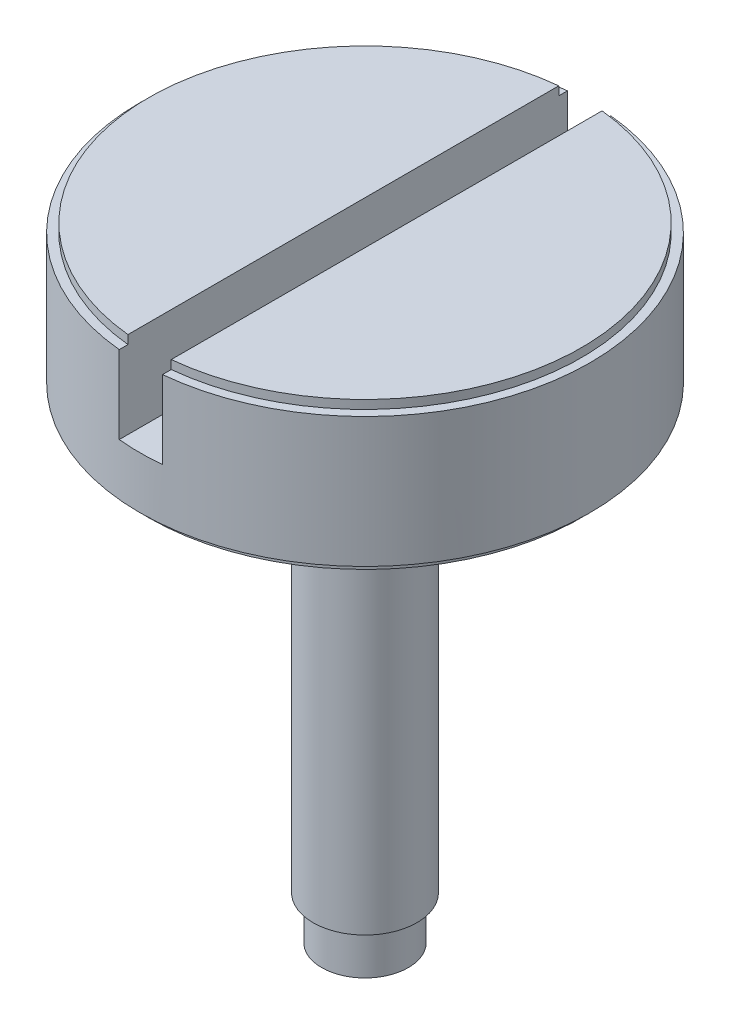
ISO-10303-21;
HEADER;
FILE_DESCRIPTION(('STEP AP214'),'2;1');
FILE_NAME('part.step','',(''),(''),'','','');
FILE_SCHEMA(('AUTOMOTIVE_DESIGN { 1 0 10303 214 1 1 1 1 }'));
ENDSEC;
DATA;
#1=APPLICATION_CONTEXT('core data for automotive mechanical design processes');
#2=APPLICATION_PROTOCOL_DEFINITION('international standard','automotive_design',2000,#1);
#3=PRODUCT_CONTEXT('',#1,'mechanical');
#4=PRODUCT('Part','Part','',(#3));
#5=PRODUCT_RELATED_PRODUCT_CATEGORY('part','',(#4));
#6=PRODUCT_DEFINITION_FORMATION('','',#4);
#7=PRODUCT_DEFINITION_CONTEXT('part definition',#1,'design');
#8=PRODUCT_DEFINITION('design','',#6,#7);
#9=PRODUCT_DEFINITION_SHAPE('','',#8);
#10=(LENGTH_UNIT() NAMED_UNIT(*) SI_UNIT(.MILLI.,.METRE.));
#11=(NAMED_UNIT(*) PLANE_ANGLE_UNIT() SI_UNIT($,.RADIAN.));
#12=(NAMED_UNIT(*) SI_UNIT($,.STERADIAN.) SOLID_ANGLE_UNIT());
#13=UNCERTAINTY_MEASURE_WITH_UNIT(LENGTH_MEASURE(1.E-05),#10,'distance_accuracy_value','');
#14=(GEOMETRIC_REPRESENTATION_CONTEXT(3) GLOBAL_UNCERTAINTY_ASSIGNED_CONTEXT((#13)) GLOBAL_UNIT_ASSIGNED_CONTEXT((#10,
#11,#12)) REPRESENTATION_CONTEXT('',''));
#15=CARTESIAN_POINT('',(0.,0.,0.));
#16=DIRECTION('',(0.,0.,1.));
#17=DIRECTION('',(1.,0.,0.));
#18=AXIS2_PLACEMENT_3D('',#15,#16,#17);
#19=CARTESIAN_POINT('',(0.,14.2,0.));
#20=DIRECTION('',(0.,1.,0.));
#21=DIRECTION('',(0.,0.,1.));
#22=AXIS2_PLACEMENT_3D('',#19,#20,#21);
#23=PLANE('',#22);
#24=DIRECTION('',(0.,0.,1.));
#25=VECTOR('',#24,1.);
#26=CARTESIAN_POINT('',(-0.5,14.2,0.));
#27=LINE('',#26,#25);
#28=CARTESIAN_POINT('',(-0.5,14.2,-5.17590571784301));
#29=VERTEX_POINT('',#28);
#30=CARTESIAN_POINT('',(-0.5,14.2,-4.9749371855331));
#31=VERTEX_POINT('',#30);
#32=EDGE_CURVE('E238',#29,#31,#27,.T.);
#33=ORIENTED_EDGE('',*,*,#32,.F.);
#34=CARTESIAN_POINT('',(0.,14.2,0.));
#35=DIRECTION('',(0.,1.,0.));
#36=DIRECTION('',(0.,0.,1.));
#37=AXIS2_PLACEMENT_3D('',#34,#35,#36);
#38=CIRCLE('',#37,5.2);
#39=CARTESIAN_POINT('',(-0.5,14.2,5.17590571784301));
#40=VERTEX_POINT('',#39);
#41=EDGE_CURVE('E142',#29,#40,#38,.T.);
#42=ORIENTED_EDGE('',*,*,#41,.T.);
#43=CARTESIAN_POINT('',(-0.5,14.2,4.9749371855331));
#44=VERTEX_POINT('',#43);
#45=EDGE_CURVE('E236',#44,#40,#27,.T.);
#46=ORIENTED_EDGE('',*,*,#45,.F.);
#47=CARTESIAN_POINT('',(0.,14.2,0.));
#48=DIRECTION('',(0.,1.,0.));
#49=DIRECTION('',(0.,0.,1.));
#50=AXIS2_PLACEMENT_3D('',#47,#48,#49);
#51=CIRCLE('',#50,5.);
#52=EDGE_CURVE('E149',#31,#44,#51,.T.);
#53=ORIENTED_EDGE('',*,*,#52,.F.);
#54=EDGE_LOOP('',(#33,#42,#46,#53));
#55=FACE_BOUND('',#54,.T.);
#56=ADVANCED_FACE('F55',(#55),#23,.T.);
#57=CARTESIAN_POINT('',(0.,14.4,0.));
#58=DIRECTION('',(0.,-1.,0.));
#59=DIRECTION('',(0.,0.,-1.));
#60=AXIS2_PLACEMENT_3D('',#57,#58,#59);
#61=CYLINDRICAL_SURFACE('',#60,5.);
#62=CARTESIAN_POINT('',(0.,14.4,0.));
#63=DIRECTION('',(0.,1.,0.));
#64=DIRECTION('',(0.,0.,1.));
#65=AXIS2_PLACEMENT_3D('',#62,#63,#64);
#66=CIRCLE('',#65,5.);
#67=CARTESIAN_POINT('',(-0.5,14.4,-4.9749371855331));
#68=VERTEX_POINT('',#67);
#69=CARTESIAN_POINT('',(-0.5,14.4,4.9749371855331));
#70=VERTEX_POINT('',#69);
#71=EDGE_CURVE('E139',#68,#70,#66,.T.);
#72=ORIENTED_EDGE('',*,*,#71,.F.);
#73=DIRECTION('',(0.,-1.,0.));
#74=VECTOR('',#73,1.);
#75=CARTESIAN_POINT('',(-0.5,14.4,-4.9749371855331));
#76=LINE('',#75,#74);
#77=EDGE_CURVE('E239',#68,#31,#76,.T.);
#78=ORIENTED_EDGE('',*,*,#77,.T.);
#79=ORIENTED_EDGE('',*,*,#52,.T.);
#80=DIRECTION('',(0.,-1.,0.));
#81=VECTOR('',#80,1.);
#82=CARTESIAN_POINT('',(-0.5,14.4,4.9749371855331));
#83=LINE('',#82,#81);
#84=EDGE_CURVE('E234',#44,#70,#83,.F.);
#85=ORIENTED_EDGE('',*,*,#84,.T.);
#86=EDGE_LOOP('',(#72,#78,#79,#85));
#87=FACE_BOUND('',#86,.T.);
#88=ADVANCED_FACE('F245',(#87),#61,.T.);
#89=CARTESIAN_POINT('',(0.,14.4,0.));
#90=DIRECTION('',(0.,1.,0.));
#91=DIRECTION('',(0.,0.,1.));
#92=AXIS2_PLACEMENT_3D('',#89,#90,#91);
#93=PLANE('',#92);
#94=DIRECTION('',(0.,0.,1.));
#95=VECTOR('',#94,1.);
#96=CARTESIAN_POINT('',(-0.5,14.4,0.));
#97=LINE('',#96,#95);
#98=EDGE_CURVE('E125',#68,#70,#97,.T.);
#99=ORIENTED_EDGE('',*,*,#98,.F.);
#100=ORIENTED_EDGE('',*,*,#71,.T.);
#101=EDGE_LOOP('',(#99,#100));
#102=FACE_BOUND('',#101,.T.);
#103=ADVANCED_FACE('F264',(#102),#93,.T.);
#104=CARTESIAN_POINT('',(0.,1.,0.));
#105=DIRECTION('',(0.,-1.,0.));
#106=DIRECTION('',(0.,0.,-1.));
#107=AXIS2_PLACEMENT_3D('',#104,#105,#106);
#108=CYLINDRICAL_SURFACE('',#107,0.999999999999999);
#109=CARTESIAN_POINT('',(0.,1.,0.));
#110=DIRECTION('',(0.,1.,0.));
#111=DIRECTION('',(0.,0.,1.));
#112=AXIS2_PLACEMENT_3D('',#109,#110,#111);
#113=CIRCLE('',#112,0.999999999999999);
#114=CARTESIAN_POINT('',(0.,1.,0.999999999999999));
#115=VERTEX_POINT('',#114);
#116=EDGE_CURVE('E126',#115,#115,#113,.T.);
#117=ORIENTED_EDGE('',*,*,#116,.F.);
#118=EDGE_LOOP('',(#117));
#119=FACE_BOUND('',#118,.T.);
#120=CARTESIAN_POINT('',(0.,0.,0.));
#121=DIRECTION('',(0.,1.,0.));
#122=DIRECTION('',(0.,0.,1.));
#123=AXIS2_PLACEMENT_3D('',#120,#121,#122);
#124=CIRCLE('',#123,0.999999999999999);
#125=CARTESIAN_POINT('',(0.,0.,0.999999999999999));
#126=VERTEX_POINT('',#125);
#127=EDGE_CURVE('E203',#126,#126,#124,.T.);
#128=ORIENTED_EDGE('',*,*,#127,.T.);
#129=EDGE_LOOP('',(#128));
#130=FACE_BOUND('',#129,.T.);
#131=ADVANCED_FACE('F57',(#119,#130),#108,.T.);
#132=CARTESIAN_POINT('',(0.,0.,0.));
#133=DIRECTION('',(0.,1.,0.));
#134=DIRECTION('',(0.,0.,1.));
#135=AXIS2_PLACEMENT_3D('',#132,#133,#134);
#136=PLANE('',#135);
#137=ORIENTED_EDGE('',*,*,#127,.F.);
#138=EDGE_LOOP('',(#137));
#139=FACE_BOUND('',#138,.T.);
#140=ADVANCED_FACE('F310',(#139),#136,.F.);
#141=CARTESIAN_POINT('',(0.,10.,0.));
#142=DIRECTION('',(0.,-1.,0.));
#143=DIRECTION('',(0.,0.,-1.));
#144=AXIS2_PLACEMENT_3D('',#141,#142,#143);
#145=CYLINDRICAL_SURFACE('',#144,1.2);
#146=CARTESIAN_POINT('',(0.,10.,0.));
#147=DIRECTION('',(0.,1.,0.));
#148=DIRECTION('',(0.,0.,1.));
#149=AXIS2_PLACEMENT_3D('',#146,#147,#148);
#150=CIRCLE('',#149,1.2);
#151=CARTESIAN_POINT('',(0.,10.,1.2));
#152=VERTEX_POINT('',#151);
#153=EDGE_CURVE('E405',#152,#152,#150,.T.);
#154=ORIENTED_EDGE('',*,*,#153,.F.);
#155=EDGE_LOOP('',(#154));
#156=FACE_BOUND('',#155,.T.);
#157=CARTESIAN_POINT('',(0.,1.,0.));
#158=DIRECTION('',(0.,1.,0.));
#159=DIRECTION('',(0.,0.,1.));
#160=AXIS2_PLACEMENT_3D('',#157,#158,#159);
#161=CIRCLE('',#160,1.2);
#162=CARTESIAN_POINT('',(0.,1.,1.2));
#163=VERTEX_POINT('',#162);
#164=EDGE_CURVE('E407',#163,#163,#161,.T.);
#165=ORIENTED_EDGE('',*,*,#164,.T.);
#166=EDGE_LOOP('',(#165));
#167=FACE_BOUND('',#166,.T.);
#168=ADVANCED_FACE('F303',(#156,#167),#145,.T.);
#169=CARTESIAN_POINT('',(0.,1.,0.));
#170=DIRECTION('',(0.,1.,0.));
#171=DIRECTION('',(0.,0.,1.));
#172=AXIS2_PLACEMENT_3D('',#169,#170,#171);
#173=PLANE('',#172);
#174=ORIENTED_EDGE('',*,*,#116,.T.);
#175=EDGE_LOOP('',(#174));
#176=FACE_BOUND('',#175,.T.);
#177=ORIENTED_EDGE('',*,*,#164,.F.);
#178=EDGE_LOOP('',(#177));
#179=FACE_BOUND('',#178,.T.);
#180=ADVANCED_FACE('F192',(#176,#179),#173,.F.);
#181=CARTESIAN_POINT('',(0.,10.,0.));
#182=DIRECTION('',(0.,1.,0.));
#183=DIRECTION('',(0.,0.,1.));
#184=AXIS2_PLACEMENT_3D('',#181,#182,#183);
#185=PLANE('',#184);
#186=ORIENTED_EDGE('',*,*,#153,.T.);
#187=EDGE_LOOP('',(#186));
#188=FACE_BOUND('',#187,.T.);
#189=CARTESIAN_POINT('',(0.269274222513664,10.,-2.9878907933674));
#190=CARTESIAN_POINT('',(0.3535949662469,10.,-2.98029334321863));
#191=CARTESIAN_POINT('',(0.43758711116998,10.,-2.96919039976817));
#192=CARTESIAN_POINT('',(0.604365917064484,10.,-2.93994673145011));
#193=CARTESIAN_POINT('',(0.687152315975199,10.,-2.9218044996425));
#194=CARTESIAN_POINT('',(0.850950764691618,10.,-2.87853199855194));
#195=CARTESIAN_POINT('',(0.931961289187081,10.,-2.8533959578247));
#196=CARTESIAN_POINT('',(1.09154118486771,10.,-2.79630109655893));
#197=CARTESIAN_POINT('',(1.17011058193846,10.,-2.76434234839636));
#198=CARTESIAN_POINT('',(1.3238171587039,10.,-2.69402872193813));
#199=CARTESIAN_POINT('',(1.39897064719419,10.,-2.65570948677648));
#200=CARTESIAN_POINT('',(1.54574792511625,10.,-2.5728594857072));
#201=CARTESIAN_POINT('',(1.61737248601742,10.,-2.52833008564923));
#202=CARTESIAN_POINT('',(1.75659246654467,10.,-2.43340757898826));
#203=CARTESIAN_POINT('',(1.82418932015163,10.,-2.38301657837825));
#204=CARTESIAN_POINT('',(1.95496727146471,10.,-2.27670727319843));
#205=CARTESIAN_POINT('',(2.01814405350176,10.,-2.22078369183863));
#206=CARTESIAN_POINT('',(2.20014147344705,10.,-2.04552116257442));
#207=CARTESIAN_POINT('',(2.31171710193813,10.,-1.91849343553664));
#208=CARTESIAN_POINT('',(2.51214426039397,10.,-1.64762290030707));
#209=CARTESIAN_POINT('',(2.60099633844804,10.,-1.5037804978052));
#210=CARTESIAN_POINT('',(2.71556253863306,10.,-1.27791485694996));
#211=CARTESIAN_POINT('',(2.75074857079674,10.,-1.20056984312493));
#212=CARTESIAN_POINT('',(2.81439602945705,10.,-1.04322291526232));
#213=CARTESIAN_POINT('',(2.84286375587396,10.,-0.963223571211891));
#214=CARTESIAN_POINT('',(2.89287792763496,10.,-0.801065329070136));
#215=CARTESIAN_POINT('',(2.91442204778072,10.,-0.718905715482246));
#216=CARTESIAN_POINT('',(2.95041156810387,10.,-0.553027548738317));
#217=CARTESIAN_POINT('',(2.96485557730498,10.,-0.469308693444249));
#218=CARTESIAN_POINT('',(2.98641256316022,10.,-0.301945121708789));
#219=CARTESIAN_POINT('',(2.99361058291746,10.,-0.218311337089248));
#220=CARTESIAN_POINT('',(3.00095726488157,10.,-0.0507383784805442));
#221=CARTESIAN_POINT('',(3.00110609248545,10.,0.0332007882971433));
#222=CARTESIAN_POINT('',(2.99445222061863,10.,0.200810592727881));
#223=CARTESIAN_POINT('',(2.98764869354656,10.,0.284481197222049));
#224=CARTESIAN_POINT('',(2.96716149251519,10.,0.45098097081665));
#225=CARTESIAN_POINT('',(2.95347752092114,10.,0.533810103358484));
#226=CARTESIAN_POINT('',(2.91901980789733,10.,0.698948697491085));
#227=CARTESIAN_POINT('',(2.89816869778,10.,0.7812420606044));
#228=CARTESIAN_POINT('',(2.8495317464831,10.,0.943731705790292));
#229=CARTESIAN_POINT('',(2.821747485817,10.,1.02392846121843));
#230=CARTESIAN_POINT('',(2.75944365032711,10.,1.18161208767407));
#231=CARTESIAN_POINT('',(2.72492811202608,10.,1.25910055009702));
#232=CARTESIAN_POINT('',(2.64939533348656,10.,1.41090808473897));
#233=CARTESIAN_POINT('',(2.60837201333979,10.,1.4852241098771));
#234=CARTESIAN_POINT('',(2.47711260722176,10.,1.70074133653191));
#235=CARTESIAN_POINT('',(2.37786273052012,10.,1.83658280158418));
#236=CARTESIAN_POINT('',(2.1581565017859,10.,2.08986980821863));
#237=CARTESIAN_POINT('',(2.03769866898255,10.,2.2073140641978));
#238=CARTESIAN_POINT('',(1.8431533951562,10.,2.36779893891778));
#239=CARTESIAN_POINT('',(1.77558358368718,10.,2.41891795535355));
#240=CARTESIAN_POINT('',(1.63643960260004,10.,2.51526585203908));
#241=CARTESIAN_POINT('',(1.5648693671063,10.,2.56050037846575));
#242=CARTESIAN_POINT('',(1.41817209121328,10.,2.64478473137917));
#243=CARTESIAN_POINT('',(1.34304473108192,10.,2.68383400052816));
#244=CARTESIAN_POINT('',(1.18973873014599,10.,2.75545323813032));
#245=CARTESIAN_POINT('',(1.11155937895859,9.99999999999999,2.78802168721864));
#246=CARTESIAN_POINT('',(0.952718312633871,9.99999999999999,2.84640440873922));
#247=CARTESIAN_POINT('',(0.872056614209032,10.,2.87221872663275));
#248=CARTESIAN_POINT('',(0.708827972427856,10.,2.91688445347068));
#249=CARTESIAN_POINT('',(0.62626104489514,10.,2.93573592022201));
#250=CARTESIAN_POINT('',(0.459802465036528,10.,2.96633492700338));
#251=CARTESIAN_POINT('',(0.375910521534517,10.,2.97808088264672));
#252=CARTESIAN_POINT('',(0.207429855281762,10.,2.99439765600828));
#253=CARTESIAN_POINT('',(0.122841113717145,10.,2.9989682793466));
#254=CARTESIAN_POINT('',(-0.0455854283668017,10.,3.00093951060037));
#255=CARTESIAN_POINT('',(-0.12942244853795,10.,2.99841006781543));
#256=CARTESIAN_POINT('',(-0.296603148545975,10.,2.98646518194419));
#257=CARTESIAN_POINT('',(-0.379946831242397,10.,2.97704977881065));
#258=CARTESIAN_POINT('',(-0.545554468285767,10.,2.95133361369543));
#259=CARTESIAN_POINT('',(-0.627818593321763,10.,2.93503395404464));
#260=CARTESIAN_POINT('',(-0.79068987992556,10.,2.89558215935315));
#261=CARTESIAN_POINT('',(-0.871297009311464,10.,2.87242989135643));
#262=CARTESIAN_POINT('',(-1.03121633666752,10.,2.81909299153848));
#263=CARTESIAN_POINT('',(-1.11050179984041,10.,2.78882813417242));
#264=CARTESIAN_POINT('',(-1.26618171956394,10.,2.72164531857193));
#265=CARTESIAN_POINT('',(-1.34257673239892,10.,2.68472864848031));
#266=CARTESIAN_POINT('',(-1.49192434052161,10.,2.604530543772));
#267=CARTESIAN_POINT('',(-1.5648779977876,10.,2.56125108986362));
#268=CARTESIAN_POINT('',(-1.70690269902471,10.,2.46863221617372));
#269=CARTESIAN_POINT('',(-1.77597005194771,10.,2.41928717258335));
#270=CARTESIAN_POINT('',(-1.97502931078477,10.,2.26391416820826));
#271=CARTESIAN_POINT('',(-2.09867612448379,10.,2.14957692803149));
#272=CARTESIAN_POINT('',(-2.32528402787939,10.,1.90197028623248));
#273=CARTESIAN_POINT('',(-2.42824451089176,10.,1.76870032955127));
#274=CARTESIAN_POINT('',(-2.56553346286884,10.,1.55664511138338));
#275=CARTESIAN_POINT('',(-2.60865884964686,10.,1.48342327023662));
#276=CARTESIAN_POINT('',(-2.6885336396272,10.,1.33364878991471));
#277=CARTESIAN_POINT('',(-2.7252890912456,10.,1.25709939770568));
#278=CARTESIAN_POINT('',(-2.79216963301598,10.,1.10114554417733));
#279=CARTESIAN_POINT('',(-2.82229397258826,10.,1.0217407608367));
#280=CARTESIAN_POINT('',(-2.87567226323666,10.,0.860655122283013));
#281=CARTESIAN_POINT('',(-2.89892469019401,10.,0.778973766539191));
#282=CARTESIAN_POINT('',(-2.95773516501022,10.,0.5327102613727));
#283=CARTESIAN_POINT('',(-2.98293532360181,10.,0.365531297503584));
#284=CARTESIAN_POINT('',(-3.00479011068607,10.,0.0292917945683101));
#285=CARTESIAN_POINT('',(-3.00143495899076,10.,-0.139769369350207));
#286=CARTESIAN_POINT('',(-2.97560778659535,10.,-0.391171579832281));
#287=CARTESIAN_POINT('',(-2.96350750898242,10.,-0.474700552829499));
#288=CARTESIAN_POINT('',(-2.93232614775868,10.,-0.640463889467551));
#289=CARTESIAN_POINT('',(-2.91324550468249,10.,-0.722698334465212));
#290=CARTESIAN_POINT('',(-2.86819419702961,10.,-0.885215645173526));
#291=CARTESIAN_POINT('',(-2.84222687916894,10.,-0.965499438210253));
#292=CARTESIAN_POINT('',(-2.78357223881624,10.,-1.12358269355903));
#293=CARTESIAN_POINT('',(-2.75088258343618,10.,-1.20138128255979));
#294=CARTESIAN_POINT('',(-2.64319402125729,10.,-1.42988880413669));
#295=CARTESIAN_POINT('',(-2.55845360017833,10.,-1.57614758224549));
#296=CARTESIAN_POINT('',(-2.36567697242997,10.,-1.85232637246166));
#297=CARTESIAN_POINT('',(-2.25763509932626,10.,-1.98224239815903));
#298=CARTESIAN_POINT('',(-2.02135570554183,10.,-2.22236323280154));
#299=CARTESIAN_POINT('',(-1.89310628240086,10.,-2.3325563425171));
#300=CARTESIAN_POINT('',(-1.62002450295532,10.,-2.5300676994666));
#301=CARTESIAN_POINT('',(-1.47518933378041,10.,-2.61738205828294));
#302=CARTESIAN_POINT('',(-1.17177151334944,10.,-2.76709043723813));
#303=CARTESIAN_POINT('',(-1.01309154765963,10.,-2.82928728876391));
#304=CARTESIAN_POINT('',(-0.687594926360803,10.,-2.92568290181971));
#305=CARTESIAN_POINT('',(-0.520789455803414,10.,-2.95991905923234));
#306=CARTESIAN_POINT('',(-0.249308975731479,10.,-2.99185807202181));
#307=CARTESIAN_POINT('',(-0.145604990201286,10.,-2.99857676330501));
#308=CARTESIAN_POINT('',(0.061988746115984,10.,-3.00125216318789));
#309=CARTESIAN_POINT('',(0.16587852702979,10.,-2.99720693085927));
#310=CARTESIAN_POINT('',(0.269274222513664,10.,-2.9878907933674));
#311=B_SPLINE_CURVE_WITH_KNOTS('',3,(#189,#190,#191,#192,#193,#194,#195,#196,#197,#198,#199,
#200,#201,#202,#203,#204,#205,#206,#207,#208,#209,#210,#211,#212,#213,#214,#215,#216,#217,#218,
#219,#220,#221,#222,#223,#224,#225,#226,#227,#228,#229,#230,#231,#232,#233,#234,#235,#236,#237,
#238,#239,#240,#241,#242,#243,#244,#245,#246,#247,#248,#249,#250,#251,#252,#253,#254,#255,#256,
#257,#258,#259,#260,#261,#262,#263,#264,#265,#266,#267,#268,#269,#270,#271,#272,#273,#274,#275,
#276,#277,#278,#279,#280,#281,#282,#283,#284,#285,#286,#287,#288,#289,#290,#291,#292,#293,#294,
#295,#296,#297,#298,#299,#300,#301,#302,#303,#304,#305,#306,#307,#308,#309,#310),.UNSPECIFIED.,
.T.,.F.,(4,2,2,2,2,2,2,2,2,2,2,2,2,2,2,2,2,2,2,2,2,2,2,2,2,2,2,2,2,2,2,2,2,2,2,2,2,2,2,2,2,2,2,
2,2,2,2,2,2,2,2,2,2,2,2,2,2,2,2,2,4),(0.,0.253889375308322,0.507833132155881,0.761987073677586,
1.01613831924359,1.26891066004067,1.52162749407719,1.77425380923659,2.02712343737536,
2.5318292823122,3.0365229526562,3.29118219089371,3.54560167152338,3.80010650637715,
4.05466118119026,4.30619214779431,4.55771721265987,4.80927222230694,5.06083811467472,
5.31520967048285,5.56952329145039,5.82368487536272,6.07808532403363,6.58028509962758,
7.08251995346606,7.33645349049431,7.59014155201396,7.8438524597302,8.09762277759087,
8.35139138730883,8.60515789014411,8.85898095699076,9.11281089979064,9.36414893147895,
9.61548550490009,9.86678184869087,10.1180830685155,10.3723677559454,10.6266032532288,
10.8807597749759,11.1351537450472,11.6378897633735,12.1406405236811,12.3953180277263,
12.6497523680405,12.9042154931443,13.158735013242,13.6633386292369,14.168115078821,
14.421075728694,14.6740204168371,14.9268424060339,15.1797522818861,15.6842253206573,
16.1888211755096,16.6937153614101,17.1986953023373,17.7075656101829,18.2157542124131,
18.5270220495861,18.8383460177311),.UNSPECIFIED.);
#312=CARTESIAN_POINT('',(-0.269274222513664,10.,2.9878907933674));
#313=VERTEX_POINT('',#312);
#314=EDGE_CURVE('E156',#313,#313,#311,.F.);
#315=ORIENTED_EDGE('',*,*,#314,.F.);
#316=EDGE_LOOP('',(#315));
#317=FACE_BOUND('',#316,.T.);
#318=ADVANCED_FACE('F188',(#188,#317),#185,.F.);
#319=CARTESIAN_POINT('',(-0.269274222513664,10.,2.9878907933674));
#320=CARTESIAN_POINT('',(-0.279243710660387,10.3333333333333,3.15432365308544));
#321=CARTESIAN_POINT('',(-0.28921319880711,10.6666666666667,3.32075651280348));
#322=CARTESIAN_POINT('',(-0.299182686953834,11.,3.48718937252153));
#323=CARTESIAN_POINT('',(-0.186821133670139,10.,2.99532161762693));
#324=CARTESIAN_POINT('',(-0.192197782145721,10.3333333333333,3.16202959285245));
#325=CARTESIAN_POINT('',(-0.197574430621304,10.6666666666667,3.32873756807796));
#326=CARTESIAN_POINT('',(-0.202951079096887,11.,3.49544554330347));
#327=CARTESIAN_POINT('',(-0.0228628310983415,10.,3.00334932732417));
#328=CARTESIAN_POINT('',(-0.0191178679772943,10.3333333333333,3.17022947757239));
#329=CARTESIAN_POINT('',(-0.0153729048562471,10.6666666666667,3.33710962782062));
#330=CARTESIAN_POINT('',(-0.0116279417351999,11.,3.50398977806884));
#331=CARTESIAN_POINT('',(0.219390025979412,10.,2.99559099835457));
#332=CARTESIAN_POINT('',(0.23657965771969,10.3333333333333,3.16163564063013));
#333=CARTESIAN_POINT('',(0.253769289459969,10.6666666666667,3.32768028290569));
#334=CARTESIAN_POINT('',(0.270958921200247,11.,3.49372492518125));
#335=CARTESIAN_POINT('',(0.457117314843039,10.,2.9687346988195));
#336=CARTESIAN_POINT('',(0.487468320888075,10.3333333333333,3.13289046008568));
#337=CARTESIAN_POINT('',(0.517819326933111,10.6666666666667,3.29704622135185));
#338=CARTESIAN_POINT('',(0.548170332978146,11.,3.46120198261803));
#339=CARTESIAN_POINT('',(1.85128181013493,10.,2.6972206159163));
#340=CARTESIAN_POINT('',(1.95862802288911,10.3333333333333,2.84396523772575));
#341=CARTESIAN_POINT('',(2.06597423564329,10.6666666666667,2.9907098595352));
#342=CARTESIAN_POINT('',(2.17332044839747,11.,3.13745448134464));
#343=CARTESIAN_POINT('',(2.86899760521487,10.,1.58852364401007));
#344=CARTESIAN_POINT('',(3.03102861681337,10.3333333333333,1.67197856689504));
#345=CARTESIAN_POINT('',(3.19305962841187,10.6666666666667,1.75543348978002));
#346=CARTESIAN_POINT('',(3.35509064001037,11.,1.83888841266499));
#347=CARTESIAN_POINT('',(3.13650727855806,10.,-1.37978755435684));
#348=CARTESIAN_POINT('',(3.30844244842553,10.3333333333333,-1.46167485963293));
#349=CARTESIAN_POINT('',(3.480377618293,10.6666666666667,-1.54356216490902));
#350=CARTESIAN_POINT('',(3.65231278816047,11.,-1.62544947018511));
#351=CARTESIAN_POINT('',(1.91833599938417,10.,-2.83927430817673));
#352=CARTESIAN_POINT('',(2.02016228095371,10.3333333333333,-3.00020485774535));
#353=CARTESIAN_POINT('',(2.12198856252324,10.6666666666667,-3.16113540731397));
#354=CARTESIAN_POINT('',(2.22381484409278,11.,-3.32206595688258));
#355=CARTESIAN_POINT('',(-1.37978755435684,10.,-3.13650727855806));
#356=CARTESIAN_POINT('',(-1.46167485963293,10.3333333333333,-3.30844244842553));
#357=CARTESIAN_POINT('',(-1.54356216490902,10.6666666666667,-3.480377618293));
#358=CARTESIAN_POINT('',(-1.62544947018511,11.,-3.65231278816047));
#359=CARTESIAN_POINT('',(-2.83927430817673,10.,-1.91833599938417));
#360=CARTESIAN_POINT('',(-3.00020485774535,10.3333333333333,-2.02016228095371));
#361=CARTESIAN_POINT('',(-3.16113540731397,10.6666666666667,-2.12198856252324));
#362=CARTESIAN_POINT('',(-3.32206595688258,11.,-2.22381484409278));
#363=CARTESIAN_POINT('',(-3.10678398151993,10.,1.04997519898274));
#364=CARTESIAN_POINT('',(-3.27761868935751,10.3333333333333,1.11349114557427));
#365=CARTESIAN_POINT('',(-3.4484533971951,10.6666666666667,1.1770070921658));
#366=CARTESIAN_POINT('',(-3.61928810503268,11.,1.24052303875732));
#367=CARTESIAN_POINT('',(-2.3036923141641,10.,2.32276669364825));
#368=CARTESIAN_POINT('',(-2.42778837068449,10.3333333333333,2.45564770124058));
#369=CARTESIAN_POINT('',(-2.55188442720488,10.6666666666667,2.5885287088329));
#370=CARTESIAN_POINT('',(-2.67598048372527,11.,2.72140971642522));
#371=CARTESIAN_POINT('',(-0.980536447955108,10.,2.83917069330743));
#372=CARTESIAN_POINT('',(-1.03026628942901,10.3333333333333,2.99852953489397));
#373=CARTESIAN_POINT('',(-1.07999613090292,10.6666666666667,3.15788837648051));
#374=CARTESIAN_POINT('',(-1.12972597237682,11.,3.31724721806705));
#375=CARTESIAN_POINT('',(-0.751441343938157,10.,2.90809788685708));
#376=CARTESIAN_POINT('',(-0.788329405250799,10.3333333333333,3.07090322338012));
#377=CARTESIAN_POINT('',(-0.82521746656344,10.6666666666667,3.23370855990316));
#378=CARTESIAN_POINT('',(-0.862105527876082,11.,3.3965138964262));
#379=CARTESIAN_POINT('',(-0.514479036555756,10.,2.95904396924565));
#380=CARTESIAN_POINT('',(-0.538118304190277,10.3333333333333,3.12428377777057));
#381=CARTESIAN_POINT('',(-0.561757571824798,10.6666666666667,3.28952358629548));
#382=CARTESIAN_POINT('',(-0.58539683945932,11.,3.45476339482039));
#383=CARTESIAN_POINT('',(-0.351727311357189,10.,2.98045996910786));
#384=CARTESIAN_POINT('',(-0.366289639175053,10.3333333333333,3.14661771331844));
#385=CARTESIAN_POINT('',(-0.380851966992917,10.6666666666667,3.31277545752901));
#386=CARTESIAN_POINT('',(-0.395414294810781,11.,3.47893320173958));
#387=CARTESIAN_POINT('',(-0.269274222513664,10.,2.9878907933674));
#388=CARTESIAN_POINT('',(-0.279243710660387,10.3333333333333,3.15432365308544));
#389=CARTESIAN_POINT('',(-0.28921319880711,10.6666666666667,3.32075651280348));
#390=CARTESIAN_POINT('',(-0.299182686953834,11.,3.48718937252153));
#391=B_SPLINE_SURFACE_WITH_KNOTS('',3,3,((#319,#320,#321,#322),(#323,#324,#325,#326),(#327,#328,
#329,#330),(#331,#332,#333,#334),(#335,#336,#337,#338),(#339,#340,#341,#342),(#343,#344,#345,
#346),(#347,#348,#349,#350),(#351,#352,#353,#354),(#355,#356,#357,#358),(#359,#360,#361,#362),
(#363,#364,#365,#366),(#367,#368,#369,#370),(#371,#372,#373,#374),(#375,#376,#377,#378),(#379,
#380,#381,#382),(#383,#384,#385,#386),(#387,#388,#389,#390)),.UNSPECIFIED.,.T.,.F.,.F.,(4,1,1,1,
1,2,2,2,1,1,1,1,4),(4,4),(0.,0.0125,0.0249999999999999,0.0375000000000001,0.05,0.25,0.5,0.75,
0.95,0.9625,0.975,0.9875,1.),(0.,1.),.UNSPECIFIED.);
#392=CARTESIAN_POINT('',(0.,11.,0.));
#393=DIRECTION('',(0.,1.,0.));
#394=DIRECTION('',(0.,0.,1.));
#395=AXIS2_PLACEMENT_3D('',#392,#393,#394);
#396=CIRCLE('',#395,3.5);
#397=CARTESIAN_POINT('',(-0.299182686953834,11.,3.48718937252153));
#398=VERTEX_POINT('',#397);
#399=EDGE_CURVE('E164',#398,#398,#396,.T.);
#400=CARTESIAN_POINT('',(-0.269274222513664,10.,2.9878907933674));
#401=CARTESIAN_POINT('',(-0.269585769018249,10.0104166666667,2.99309182023359));
#402=CARTESIAN_POINT('',(-0.269897315522834,10.0208333333333,2.99829284709978));
#403=CARTESIAN_POINT('',(-0.270520408532004,10.0416666666667,3.00869490083215));
#404=CARTESIAN_POINT('',(-0.270831955036589,10.0520833333333,3.01389592769834));
#405=CARTESIAN_POINT('',(-0.271455048045759,10.0729166666667,3.02429798143072));
#406=CARTESIAN_POINT('',(-0.271766594550344,10.0833333333333,3.02949900829691));
#407=CARTESIAN_POINT('',(-0.272389687559515,10.1041666666667,3.03990106202929));
#408=CARTESIAN_POINT('',(-0.2727012340641,10.1145833333333,3.04510208889548));
#409=CARTESIAN_POINT('',(-0.27332432707327,10.1354166666667,3.05550414262785));
#410=CARTESIAN_POINT('',(-0.273635873577855,10.1458333333333,3.06070516949404));
#411=CARTESIAN_POINT('',(-0.274258966587025,10.1666666666667,3.07110722322642));
#412=CARTESIAN_POINT('',(-0.27457051309161,10.1770833333333,3.07630825009261));
#413=CARTESIAN_POINT('',(-0.275193606100781,10.1979166666667,3.08671030382499));
#414=CARTESIAN_POINT('',(-0.275505152605366,10.2083333333333,3.09191133069117));
#415=CARTESIAN_POINT('',(-0.276128245614536,10.2291666666667,3.10231338442355));
#416=CARTESIAN_POINT('',(-0.276439792119121,10.2395833333333,3.10751441128974));
#417=CARTESIAN_POINT('',(-0.277062885128291,10.2604166666667,3.11791646502212));
#418=CARTESIAN_POINT('',(-0.277374431632876,10.2708333333333,3.12311749188831));
#419=CARTESIAN_POINT('',(-0.277997524642046,10.2916666666667,3.13351954562069));
#420=CARTESIAN_POINT('',(-0.278309071146632,10.3020833333333,3.13872057248687));
#421=CARTESIAN_POINT('',(-0.278932164155802,10.3229166666667,3.14912262621925));
#422=CARTESIAN_POINT('',(-0.279243710660387,10.3333333333333,3.15432365308544));
#423=CARTESIAN_POINT('',(-0.279866803669557,10.3541666666667,3.16472570681782));
#424=CARTESIAN_POINT('',(-0.280178350174142,10.3645833333333,3.16992673368401));
#425=CARTESIAN_POINT('',(-0.280801443183312,10.3854166666667,3.18032878741639));
#426=CARTESIAN_POINT('',(-0.281112989687898,10.3958333333333,3.18552981428257));
#427=CARTESIAN_POINT('',(-0.281736082697068,10.4166666666667,3.19593186801495));
#428=CARTESIAN_POINT('',(-0.282047629201653,10.4270833333333,3.20113289488114));
#429=CARTESIAN_POINT('',(-0.282670722210823,10.4479166666667,3.21153494861352));
#430=CARTESIAN_POINT('',(-0.282982268715408,10.4583333333333,3.21673597547971));
#431=CARTESIAN_POINT('',(-0.283605361724578,10.4791666666667,3.22713802921209));
#432=CARTESIAN_POINT('',(-0.283916908229164,10.4895833333333,3.23233905607827));
#433=CARTESIAN_POINT('',(-0.284540001238334,10.5104166666667,3.24274110981065));
#434=CARTESIAN_POINT('',(-0.284851547742919,10.5208333333333,3.24794213667684));
#435=CARTESIAN_POINT('',(-0.285474640752089,10.5416666666667,3.25834419040922));
#436=CARTESIAN_POINT('',(-0.285786187256674,10.5520833333333,3.26354521727541));
#437=CARTESIAN_POINT('',(-0.286409280265844,10.5729166666667,3.27394727100779));
#438=CARTESIAN_POINT('',(-0.286720826770429,10.5833333333333,3.27914829787397));
#439=CARTESIAN_POINT('',(-0.2873439197796,10.6041666666667,3.28955035160635));
#440=CARTESIAN_POINT('',(-0.287655466284185,10.6145833333333,3.29475137847254));
#441=CARTESIAN_POINT('',(-0.288278559293355,10.6354166666667,3.30515343220492));
#442=CARTESIAN_POINT('',(-0.28859010579794,10.6458333333333,3.31035445907111));
#443=CARTESIAN_POINT('',(-0.28921319880711,10.6666666666667,3.32075651280348));
#444=CARTESIAN_POINT('',(-0.289524745311695,10.6770833333333,3.32595753966967));
#445=CARTESIAN_POINT('',(-0.290147838320866,10.6979166666667,3.33635959340205));
#446=CARTESIAN_POINT('',(-0.290459384825451,10.7083333333333,3.34156062026824));
#447=CARTESIAN_POINT('',(-0.291082477834621,10.7291666666667,3.35196267400062));
#448=CARTESIAN_POINT('',(-0.291394024339206,10.7395833333333,3.35716370086681));
#449=CARTESIAN_POINT('',(-0.292017117348376,10.7604166666667,3.36756575459918));
#450=CARTESIAN_POINT('',(-0.292328663852961,10.7708333333333,3.37276678146537));
#451=CARTESIAN_POINT('',(-0.292951756862132,10.7916666666667,3.38316883519775));
#452=CARTESIAN_POINT('',(-0.293263303366717,10.8020833333333,3.38836986206394));
#453=CARTESIAN_POINT('',(-0.293886396375887,10.8229166666667,3.39877191579632));
#454=CARTESIAN_POINT('',(-0.294197942880472,10.8333333333333,3.40397294266251));
#455=CARTESIAN_POINT('',(-0.294821035889642,10.8541666666667,3.41437499639488));
#456=CARTESIAN_POINT('',(-0.295132582394227,10.8645833333333,3.41957602326107));
#457=CARTESIAN_POINT('',(-0.295755675403398,10.8854166666667,3.42997807699345));
#458=CARTESIAN_POINT('',(-0.296067221907983,10.8958333333333,3.43517910385964));
#459=CARTESIAN_POINT('',(-0.296690314917153,10.9166666666667,3.44558115759202));
#460=CARTESIAN_POINT('',(-0.297001861421738,10.9270833333333,3.45078218445821));
#461=CARTESIAN_POINT('',(-0.297624954430908,10.9479166666667,3.46118423819058));
#462=CARTESIAN_POINT('',(-0.297936500935493,10.9583333333333,3.46638526505677));
#463=CARTESIAN_POINT('',(-0.298559593944663,10.9791666666667,3.47678731878915));
#464=CARTESIAN_POINT('',(-0.298871140449249,10.9895833333333,3.48198834565534));
#465=CARTESIAN_POINT('',(-0.299182686953834,11.,3.48718937252153));
#466=B_SPLINE_CURVE_WITH_KNOTS('',3,(#400,#401,#402,#403,#404,#405,#406,#407,#408,#409,#410,
#411,#412,#413,#414,#415,#416,#417,#418,#419,#420,#421,#422,#423,#424,#425,#426,#427,#428,#429,
#430,#431,#432,#433,#434,#435,#436,#437,#438,#439,#440,#441,#442,#443,#444,#445,#446,#447,#448,
#449,#450,#451,#452,#453,#454,#455,#456,#457,#458,#459,#460,#461,#462,#463,#464,#465),
.UNSPECIFIED.,.F.,.F.,(4,2,2,2,2,2,2,2,2,2,2,2,2,2,2,2,2,2,2,2,2,2,2,2,2,2,2,2,2,2,2,2,4),(0.,
0.0349412675097217,0.0698825350194448,0.10482380252917,0.139765070038893,0.174706337548617,
0.209647605058339,0.244588872568063,0.279530140077786,0.314471407587509,0.349412675097232,
0.384353942606955,0.419295210116678,0.454236477626402,0.489177745136125,0.524119012645848,
0.559060280155571,0.594001547665294,0.628942815175018,0.663884082684741,0.698825350194464,
0.733766617704187,0.768707885213912,0.803649152723633,0.838590420233357,0.87353168774308,
0.908472955252803,0.943414222762526,0.97835549027225,1.01329675778197,1.0482380252917,
1.08317929280142,1.11812056031114),.UNSPECIFIED.);
#467=EDGE_CURVE('BSEAM181',#313,#398,#466,.T.);
#468=ORIENTED_EDGE('',*,*,#314,.T.);
#469=ORIENTED_EDGE('',*,*,#399,.F.);
#470=ORIENTED_EDGE('',*,*,#467,.T.);
#471=ORIENTED_EDGE('',*,*,#467,.F.);
#472=EDGE_LOOP('',(#468,#470,#469,#471));
#473=FACE_BOUND('',#472,.T.);
#474=ADVANCED_FACE('F181',(#473),#391,.T.);
#475=CARTESIAN_POINT('',(0.,11.,0.));
#476=DIRECTION('',(0.,1.,0.));
#477=DIRECTION('',(0.,0.,1.));
#478=AXIS2_PLACEMENT_3D('',#475,#476,#477);
#479=PLANE('',#478);
#480=CARTESIAN_POINT('',(0.,11.,0.));
#481=DIRECTION('',(0.,1.,0.));
#482=DIRECTION('',(0.,0.,1.));
#483=AXIS2_PLACEMENT_3D('',#480,#481,#482);
#484=CIRCLE('',#483,5.);
#485=CARTESIAN_POINT('',(0.,11.,5.));
#486=VERTEX_POINT('',#485);
#487=EDGE_CURVE('E157',#486,#486,#484,.T.);
#488=ORIENTED_EDGE('',*,*,#487,.F.);
#489=EDGE_LOOP('',(#488));
#490=FACE_BOUND('',#489,.T.);
#491=ORIENTED_EDGE('',*,*,#399,.T.);
#492=EDGE_LOOP('',(#491));
#493=FACE_BOUND('',#492,.T.);
#494=ADVANCED_FACE('F170',(#490,#493),#479,.F.);
#495=CARTESIAN_POINT('',(0.,11.2,0.));
#496=DIRECTION('',(0.,-1.,0.));
#497=DIRECTION('',(0.,0.,-1.));
#498=AXIS2_PLACEMENT_3D('',#495,#496,#497);
#499=CYLINDRICAL_SURFACE('',#498,5.);
#500=CARTESIAN_POINT('',(0.,11.2,0.));
#501=DIRECTION('',(0.,1.,0.));
#502=DIRECTION('',(0.,0.,1.));
#503=AXIS2_PLACEMENT_3D('',#500,#501,#502);
#504=CIRCLE('',#503,5.);
#505=CARTESIAN_POINT('',(0.,11.2,5.));
#506=VERTEX_POINT('',#505);
#507=EDGE_CURVE('E153',#506,#506,#504,.T.);
#508=ORIENTED_EDGE('',*,*,#507,.F.);
#509=EDGE_LOOP('',(#508));
#510=FACE_BOUND('',#509,.T.);
#511=ORIENTED_EDGE('',*,*,#487,.T.);
#512=EDGE_LOOP('',(#511));
#513=FACE_BOUND('',#512,.T.);
#514=ADVANCED_FACE('F180',(#510,#513),#499,.T.);
#515=CARTESIAN_POINT('',(0.,14.2,0.));
#516=DIRECTION('',(0.,-1.,0.));
#517=DIRECTION('',(0.,0.,-1.));
#518=AXIS2_PLACEMENT_3D('',#515,#516,#517);
#519=CYLINDRICAL_SURFACE('',#518,5.2);
#520=CARTESIAN_POINT('',(0.,12.4,0.));
#521=DIRECTION('',(0.,-1.,0.));
#522=DIRECTION('',(0.,0.,-1.));
#523=AXIS2_PLACEMENT_3D('',#520,#521,#522);
#524=CIRCLE('',#523,5.2);
#525=CARTESIAN_POINT('',(-0.5,12.4,-5.17590571784301));
#526=VERTEX_POINT('',#525);
#527=CARTESIAN_POINT('',(0.5,12.4,-5.17590571784301));
#528=VERTEX_POINT('',#527);
#529=EDGE_CURVE('E13',#526,#528,#524,.T.);
#530=ORIENTED_EDGE('',*,*,#529,.T.);
#531=DIRECTION('',(0.,-1.,0.));
#532=VECTOR('',#531,1.);
#533=CARTESIAN_POINT('',(0.5,14.2,-5.17590571784301));
#534=LINE('',#533,#532);
#535=CARTESIAN_POINT('',(0.5,14.2,-5.17590571784301));
#536=VERTEX_POINT('',#535);
#537=EDGE_CURVE('E225',#528,#536,#534,.F.);
#538=ORIENTED_EDGE('',*,*,#537,.T.);
#539=CARTESIAN_POINT('',(0.5,14.2,5.17590571784301));
#540=VERTEX_POINT('',#539);
#541=EDGE_CURVE('E151',#540,#536,#38,.T.);
#542=ORIENTED_EDGE('',*,*,#541,.F.);
#543=DIRECTION('',(0.,-1.,0.));
#544=VECTOR('',#543,1.);
#545=CARTESIAN_POINT('',(0.5,14.2,5.17590571784301));
#546=LINE('',#545,#544);
#547=CARTESIAN_POINT('',(0.5,12.4,5.17590571784301));
#548=VERTEX_POINT('',#547);
#549=EDGE_CURVE('E215',#540,#548,#546,.T.);
#550=ORIENTED_EDGE('',*,*,#549,.T.);
#551=CARTESIAN_POINT('',(-0.5,12.4,5.17590571784301));
#552=VERTEX_POINT('',#551);
#553=EDGE_CURVE('E59',#548,#552,#524,.T.);
#554=ORIENTED_EDGE('',*,*,#553,.T.);
#555=DIRECTION('',(0.,-1.,0.));
#556=VECTOR('',#555,1.);
#557=CARTESIAN_POINT('',(-0.5,14.2,5.17590571784301));
#558=LINE('',#557,#556);
#559=EDGE_CURVE('E213',#552,#40,#558,.F.);
#560=ORIENTED_EDGE('',*,*,#559,.T.);
#561=ORIENTED_EDGE('',*,*,#41,.F.);
#562=DIRECTION('',(0.,-1.,0.));
#563=VECTOR('',#562,1.);
#564=CARTESIAN_POINT('',(-0.5,14.2,-5.17590571784301));
#565=LINE('',#564,#563);
#566=EDGE_CURVE('E78',#29,#526,#565,.T.);
#567=ORIENTED_EDGE('',*,*,#566,.T.);
#568=EDGE_LOOP('',(#530,#538,#542,#550,#554,#560,#561,#567));
#569=FACE_BOUND('',#568,.T.);
#570=CARTESIAN_POINT('',(0.,11.2,0.));
#571=DIRECTION('',(0.,1.,0.));
#572=DIRECTION('',(0.,0.,1.));
#573=AXIS2_PLACEMENT_3D('',#570,#571,#572);
#574=CIRCLE('',#573,5.2);
#575=CARTESIAN_POINT('',(0.,11.2,5.2));
#576=VERTEX_POINT('',#575);
#577=EDGE_CURVE('E138',#576,#576,#574,.T.);
#578=ORIENTED_EDGE('',*,*,#577,.T.);
#579=EDGE_LOOP('',(#578));
#580=FACE_BOUND('',#579,.T.);
#581=ADVANCED_FACE('F183',(#569,#580),#519,.T.);
#582=DIRECTION('',(0.,0.,-1.));
#583=VECTOR('',#582,1.);
#584=CARTESIAN_POINT('',(0.5,14.2,0.));
#585=LINE('',#584,#583);
#586=CARTESIAN_POINT('',(0.5,14.2,4.9749371855331));
#587=VERTEX_POINT('',#586);
#588=EDGE_CURVE('E230',#540,#587,#585,.T.);
#589=ORIENTED_EDGE('',*,*,#588,.F.);
#590=ORIENTED_EDGE('',*,*,#541,.T.);
#591=CARTESIAN_POINT('',(0.5,14.2,-4.9749371855331));
#592=VERTEX_POINT('',#591);
#593=EDGE_CURVE('E134',#592,#536,#585,.T.);
#594=ORIENTED_EDGE('',*,*,#593,.F.);
#595=EDGE_CURVE('E133',#587,#592,#51,.T.);
#596=ORIENTED_EDGE('',*,*,#595,.F.);
#597=EDGE_LOOP('',(#589,#590,#594,#596));
#598=FACE_BOUND('',#597,.T.);
#599=ADVANCED_FACE('F260',(#598),#23,.T.);
#600=CARTESIAN_POINT('',(0.,11.2,0.));
#601=DIRECTION('',(0.,1.,0.));
#602=DIRECTION('',(0.,0.,1.));
#603=AXIS2_PLACEMENT_3D('',#600,#601,#602);
#604=PLANE('',#603);
#605=ORIENTED_EDGE('',*,*,#507,.T.);
#606=EDGE_LOOP('',(#605));
#607=FACE_BOUND('',#606,.T.);
#608=ORIENTED_EDGE('',*,*,#577,.F.);
#609=EDGE_LOOP('',(#608));
#610=FACE_BOUND('',#609,.T.);
#611=ADVANCED_FACE('F267',(#607,#610),#604,.F.);
#612=CARTESIAN_POINT('',(0.5,14.4,4.9749371855331));
#613=VERTEX_POINT('',#612);
#614=CARTESIAN_POINT('',(0.5,14.4,-4.9749371855331));
#615=VERTEX_POINT('',#614);
#616=EDGE_CURVE('E131',#613,#615,#66,.T.);
#617=ORIENTED_EDGE('',*,*,#616,.F.);
#618=DIRECTION('',(0.,-1.,0.));
#619=VECTOR('',#618,1.);
#620=CARTESIAN_POINT('',(0.5,14.4,4.9749371855331));
#621=LINE('',#620,#619);
#622=EDGE_CURVE('E70',#613,#587,#621,.T.);
#623=ORIENTED_EDGE('',*,*,#622,.T.);
#624=ORIENTED_EDGE('',*,*,#595,.T.);
#625=DIRECTION('',(0.,-1.,0.));
#626=VECTOR('',#625,1.);
#627=CARTESIAN_POINT('',(0.5,14.4,-4.9749371855331));
#628=LINE('',#627,#626);
#629=EDGE_CURVE('E120',#592,#615,#628,.F.);
#630=ORIENTED_EDGE('',*,*,#629,.T.);
#631=EDGE_LOOP('',(#617,#623,#624,#630));
#632=FACE_BOUND('',#631,.T.);
#633=ADVANCED_FACE('F130',(#632),#61,.T.);
#634=DIRECTION('',(0.,0.,-1.));
#635=VECTOR('',#634,1.);
#636=CARTESIAN_POINT('',(0.5,14.4,0.));
#637=LINE('',#636,#635);
#638=EDGE_CURVE('E117',#613,#615,#637,.T.);
#639=ORIENTED_EDGE('',*,*,#638,.F.);
#640=ORIENTED_EDGE('',*,*,#616,.T.);
#641=EDGE_LOOP('',(#639,#640));
#642=FACE_BOUND('',#641,.T.);
#643=ADVANCED_FACE('F137',(#642),#93,.T.);
#644=CARTESIAN_POINT('',(-0.5,12.4,-5.2));
#645=DIRECTION('',(0.,-1.,0.));
#646=DIRECTION('',(0.,0.,-1.));
#647=AXIS2_PLACEMENT_3D('',#644,#645,#646);
#648=PLANE('',#647);
#649=DIRECTION('',(0.,0.,1.));
#650=VECTOR('',#649,1.);
#651=CARTESIAN_POINT('',(0.5,12.4,-5.2));
#652=LINE('',#651,#650);
#653=EDGE_CURVE('E135',#528,#548,#652,.T.);
#654=ORIENTED_EDGE('',*,*,#653,.F.);
#655=ORIENTED_EDGE('',*,*,#529,.F.);
#656=DIRECTION('',(0.,0.,1.));
#657=VECTOR('',#656,1.);
#658=CARTESIAN_POINT('',(-0.5,12.4,-5.2));
#659=LINE('',#658,#657);
#660=EDGE_CURVE('E221',#526,#552,#659,.T.);
#661=ORIENTED_EDGE('',*,*,#660,.T.);
#662=ORIENTED_EDGE('',*,*,#553,.F.);
#663=EDGE_LOOP('',(#654,#655,#661,#662));
#664=FACE_BOUND('',#663,.T.);
#665=ADVANCED_FACE('F220',(#664),#648,.F.);
#666=CARTESIAN_POINT('',(-0.5,14.4,-5.2));
#667=DIRECTION('',(-1.,0.,0.));
#668=DIRECTION('',(0.,0.,1.));
#669=AXIS2_PLACEMENT_3D('',#666,#667,#668);
#670=PLANE('',#669);
#671=ORIENTED_EDGE('',*,*,#32,.T.);
#672=ORIENTED_EDGE('',*,*,#77,.F.);
#673=ORIENTED_EDGE('',*,*,#98,.T.);
#674=ORIENTED_EDGE('',*,*,#84,.F.);
#675=ORIENTED_EDGE('',*,*,#45,.T.);
#676=ORIENTED_EDGE('',*,*,#559,.F.);
#677=ORIENTED_EDGE('',*,*,#660,.F.);
#678=ORIENTED_EDGE('',*,*,#566,.F.);
#679=EDGE_LOOP('',(#671,#672,#673,#674,#675,#676,#677,#678));
#680=FACE_BOUND('',#679,.T.);
#681=ADVANCED_FACE('F248',(#680),#670,.F.);
#682=CARTESIAN_POINT('',(0.5,12.4,-5.2));
#683=DIRECTION('',(1.,0.,0.));
#684=DIRECTION('',(0.,0.,-1.));
#685=AXIS2_PLACEMENT_3D('',#682,#683,#684);
#686=PLANE('',#685);
#687=ORIENTED_EDGE('',*,*,#588,.T.);
#688=ORIENTED_EDGE('',*,*,#622,.F.);
#689=ORIENTED_EDGE('',*,*,#638,.T.);
#690=ORIENTED_EDGE('',*,*,#629,.F.);
#691=ORIENTED_EDGE('',*,*,#593,.T.);
#692=ORIENTED_EDGE('',*,*,#537,.F.);
#693=ORIENTED_EDGE('',*,*,#653,.T.);
#694=ORIENTED_EDGE('',*,*,#549,.F.);
#695=EDGE_LOOP('',(#687,#688,#689,#690,#691,#692,#693,#694));
#696=FACE_BOUND('',#695,.T.);
#697=ADVANCED_FACE('F119',(#696),#686,.F.);
#698=CLOSED_SHELL('',(#56,#88,#103,#131,#140,#168,#180,#318,#474,#494,#514,#581,#599,#611,#633,
#643,#665,#681,#697));
#699=MANIFOLD_SOLID_BREP('B2',#698);
#700=ADVANCED_BREP_SHAPE_REPRESENTATION('',(#18,#699),#14);
#701=SHAPE_DEFINITION_REPRESENTATION(#9,#700);
ENDSEC;
END-ISO-10303-21;
